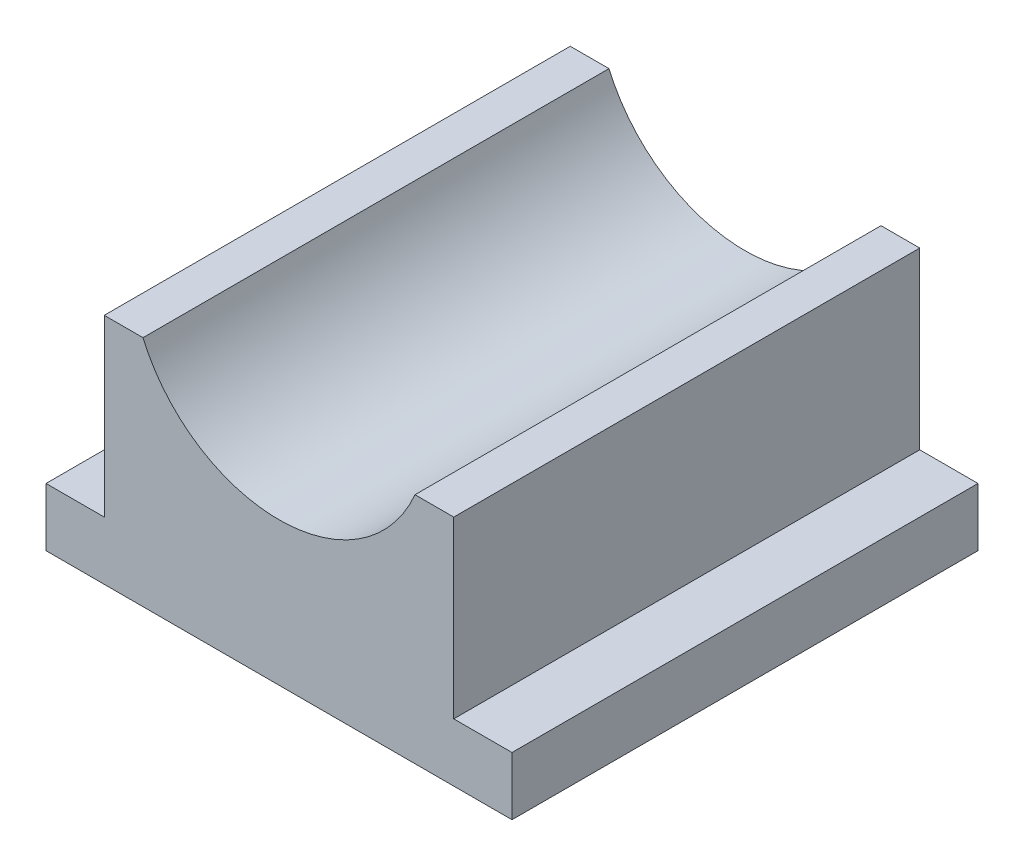
ISO-10303-21;
HEADER;
FILE_DESCRIPTION(('STEP AP214'),'2;1');
FILE_NAME('part.step','',(''),(''),'','','');
FILE_SCHEMA(('AUTOMOTIVE_DESIGN { 1 0 10303 214 1 1 1 1 }'));
ENDSEC;
DATA;
#1=APPLICATION_CONTEXT('core data for automotive mechanical design processes');
#2=APPLICATION_PROTOCOL_DEFINITION('international standard','automotive_design',2000,#1);
#3=PRODUCT_CONTEXT('',#1,'mechanical');
#4=PRODUCT('Part','Part','',(#3));
#5=PRODUCT_RELATED_PRODUCT_CATEGORY('part','',(#4));
#6=PRODUCT_DEFINITION_FORMATION('','',#4);
#7=PRODUCT_DEFINITION_CONTEXT('part definition',#1,'design');
#8=PRODUCT_DEFINITION('design','',#6,#7);
#9=PRODUCT_DEFINITION_SHAPE('','',#8);
#10=(LENGTH_UNIT() NAMED_UNIT(*) SI_UNIT(.MILLI.,.METRE.));
#11=(NAMED_UNIT(*) PLANE_ANGLE_UNIT() SI_UNIT($,.RADIAN.));
#12=(NAMED_UNIT(*) SI_UNIT($,.STERADIAN.) SOLID_ANGLE_UNIT());
#13=UNCERTAINTY_MEASURE_WITH_UNIT(LENGTH_MEASURE(1.E-05),#10,'distance_accuracy_value','');
#14=(GEOMETRIC_REPRESENTATION_CONTEXT(3) GLOBAL_UNCERTAINTY_ASSIGNED_CONTEXT((#13)) GLOBAL_UNIT_ASSIGNED_CONTEXT((#10,
#11,#12)) REPRESENTATION_CONTEXT('',''));
#15=CARTESIAN_POINT('',(0.,0.,0.));
#16=DIRECTION('',(0.,0.,1.));
#17=DIRECTION('',(1.,0.,0.));
#18=AXIS2_PLACEMENT_3D('',#15,#16,#17);
#19=CARTESIAN_POINT('',(-50.8,-50.8,101.6));
#20=DIRECTION('',(1.,0.,0.));
#21=DIRECTION('',(0.,1.,0.));
#22=AXIS2_PLACEMENT_3D('',#19,#20,#21);
#23=PLANE('',#22);
#24=DIRECTION('',(0.,-1.,0.));
#25=VECTOR('',#24,1.);
#26=CARTESIAN_POINT('',(-50.8,-50.8,0.));
#27=LINE('',#26,#25);
#28=CARTESIAN_POINT('',(-50.8,-50.8,0.));
#29=VERTEX_POINT('',#28);
#30=CARTESIAN_POINT('',(-50.8,-63.5,0.));
#31=VERTEX_POINT('',#30);
#32=EDGE_CURVE('E143',#29,#31,#27,.T.);
#33=ORIENTED_EDGE('',*,*,#32,.T.);
#34=DIRECTION('',(0.,0.,-1.));
#35=VECTOR('',#34,1.);
#36=CARTESIAN_POINT('',(-50.8,-63.5,101.6));
#37=LINE('',#36,#35);
#38=CARTESIAN_POINT('',(-50.8,-63.5,101.6));
#39=VERTEX_POINT('',#38);
#40=EDGE_CURVE('E11',#39,#31,#37,.T.);
#41=ORIENTED_EDGE('',*,*,#40,.F.);
#42=DIRECTION('',(0.,-1.,0.));
#43=VECTOR('',#42,1.);
#44=CARTESIAN_POINT('',(-50.8,-50.8,101.6));
#45=LINE('',#44,#43);
#46=CARTESIAN_POINT('',(-50.8,-50.8,101.6));
#47=VERTEX_POINT('',#46);
#48=EDGE_CURVE('E161',#47,#39,#45,.T.);
#49=ORIENTED_EDGE('',*,*,#48,.F.);
#50=DIRECTION('',(0.,0.,-1.));
#51=VECTOR('',#50,1.);
#52=CARTESIAN_POINT('',(-50.8,-50.8,101.6));
#53=LINE('',#52,#51);
#54=EDGE_CURVE('E139',#47,#29,#53,.T.);
#55=ORIENTED_EDGE('',*,*,#54,.T.);
#56=EDGE_LOOP('',(#33,#41,#49,#55));
#57=FACE_BOUND('',#56,.T.);
#58=ADVANCED_FACE('F35',(#57),#23,.F.);
#59=CARTESIAN_POINT('',(-50.8,-63.5,101.6));
#60=DIRECTION('',(0.,1.,0.));
#61=DIRECTION('',(-1.,0.,0.));
#62=AXIS2_PLACEMENT_3D('',#59,#60,#61);
#63=PLANE('',#62);
#64=DIRECTION('',(1.,0.,0.));
#65=VECTOR('',#64,1.);
#66=CARTESIAN_POINT('',(-50.8,-63.5,0.));
#67=LINE('',#66,#65);
#68=CARTESIAN_POINT('',(50.8,-63.5,0.));
#69=VERTEX_POINT('',#68);
#70=EDGE_CURVE('E146',#31,#69,#67,.T.);
#71=ORIENTED_EDGE('',*,*,#70,.T.);
#72=DIRECTION('',(0.,0.,-1.));
#73=VECTOR('',#72,1.);
#74=CARTESIAN_POINT('',(50.8,-63.5,101.6));
#75=LINE('',#74,#73);
#76=CARTESIAN_POINT('',(50.8,-63.5,101.6));
#77=VERTEX_POINT('',#76);
#78=EDGE_CURVE('E43',#77,#69,#75,.T.);
#79=ORIENTED_EDGE('',*,*,#78,.F.);
#80=DIRECTION('',(1.,0.,0.));
#81=VECTOR('',#80,1.);
#82=CARTESIAN_POINT('',(-50.8,-63.5,101.6));
#83=LINE('',#82,#81);
#84=EDGE_CURVE('E100',#39,#77,#83,.T.);
#85=ORIENTED_EDGE('',*,*,#84,.F.);
#86=ORIENTED_EDGE('',*,*,#40,.T.);
#87=EDGE_LOOP('',(#71,#79,#85,#86));
#88=FACE_BOUND('',#87,.T.);
#89=ADVANCED_FACE('F210',(#88),#63,.F.);
#90=CARTESIAN_POINT('',(50.8,-63.5,101.6));
#91=DIRECTION('',(-1.,0.,0.));
#92=DIRECTION('',(0.,-1.,0.));
#93=AXIS2_PLACEMENT_3D('',#90,#91,#92);
#94=PLANE('',#93);
#95=DIRECTION('',(0.,1.,0.));
#96=VECTOR('',#95,1.);
#97=CARTESIAN_POINT('',(50.8,-63.5,0.));
#98=LINE('',#97,#96);
#99=CARTESIAN_POINT('',(50.8,-50.8,0.));
#100=VERTEX_POINT('',#99);
#101=EDGE_CURVE('E148',#69,#100,#98,.T.);
#102=ORIENTED_EDGE('',*,*,#101,.T.);
#103=DIRECTION('',(0.,0.,-1.));
#104=VECTOR('',#103,1.);
#105=CARTESIAN_POINT('',(50.8,-50.8,101.6));
#106=LINE('',#105,#104);
#107=CARTESIAN_POINT('',(50.8,-50.8,101.6));
#108=VERTEX_POINT('',#107);
#109=EDGE_CURVE('E174',#108,#100,#106,.T.);
#110=ORIENTED_EDGE('',*,*,#109,.F.);
#111=DIRECTION('',(0.,1.,0.));
#112=VECTOR('',#111,1.);
#113=CARTESIAN_POINT('',(50.8,-63.5,101.6));
#114=LINE('',#113,#112);
#115=EDGE_CURVE('E182',#77,#108,#114,.T.);
#116=ORIENTED_EDGE('',*,*,#115,.F.);
#117=ORIENTED_EDGE('',*,*,#78,.T.);
#118=EDGE_LOOP('',(#102,#110,#116,#117));
#119=FACE_BOUND('',#118,.T.);
#120=ADVANCED_FACE('F180',(#119),#94,.F.);
#121=CARTESIAN_POINT('',(50.8,-50.8,101.6));
#122=DIRECTION('',(0.,-1.,0.));
#123=DIRECTION('',(1.,0.,0.));
#124=AXIS2_PLACEMENT_3D('',#121,#122,#123);
#125=PLANE('',#124);
#126=DIRECTION('',(-1.,0.,0.));
#127=VECTOR('',#126,1.);
#128=CARTESIAN_POINT('',(50.8,-50.8,0.));
#129=LINE('',#128,#127);
#130=CARTESIAN_POINT('',(38.1,-50.8,0.));
#131=VERTEX_POINT('',#130);
#132=EDGE_CURVE('E150',#100,#131,#129,.T.);
#133=ORIENTED_EDGE('',*,*,#132,.T.);
#134=DIRECTION('',(0.,0.,-1.));
#135=VECTOR('',#134,1.);
#136=CARTESIAN_POINT('',(38.1,-50.8,101.6));
#137=LINE('',#136,#135);
#138=CARTESIAN_POINT('',(38.1,-50.8,101.6));
#139=VERTEX_POINT('',#138);
#140=EDGE_CURVE('E171',#139,#131,#137,.T.);
#141=ORIENTED_EDGE('',*,*,#140,.F.);
#142=DIRECTION('',(-1.,0.,0.));
#143=VECTOR('',#142,1.);
#144=CARTESIAN_POINT('',(50.8,-50.8,101.6));
#145=LINE('',#144,#143);
#146=EDGE_CURVE('E200',#108,#139,#145,.T.);
#147=ORIENTED_EDGE('',*,*,#146,.F.);
#148=ORIENTED_EDGE('',*,*,#109,.T.);
#149=EDGE_LOOP('',(#133,#141,#147,#148));
#150=FACE_BOUND('',#149,.T.);
#151=ADVANCED_FACE('F191',(#150),#125,.F.);
#152=CARTESIAN_POINT('',(38.1,-12.7,101.6));
#153=DIRECTION('',(-1.,0.,0.));
#154=DIRECTION('',(0.,-1.,0.));
#155=AXIS2_PLACEMENT_3D('',#152,#153,#154);
#156=PLANE('',#155);
#157=DIRECTION('',(0.,1.,0.));
#158=VECTOR('',#157,1.);
#159=CARTESIAN_POINT('',(38.1,-12.7,0.));
#160=LINE('',#159,#158);
#161=CARTESIAN_POINT('',(38.1,-12.7,0.));
#162=VERTEX_POINT('',#161);
#163=EDGE_CURVE('E152',#131,#162,#160,.T.);
#164=ORIENTED_EDGE('',*,*,#163,.T.);
#165=DIRECTION('',(0.,0.,-1.));
#166=VECTOR('',#165,1.);
#167=CARTESIAN_POINT('',(38.1,-12.7,101.6));
#168=LINE('',#167,#166);
#169=CARTESIAN_POINT('',(38.1,-12.7,101.6));
#170=VERTEX_POINT('',#169);
#171=EDGE_CURVE('E168',#170,#162,#168,.T.);
#172=ORIENTED_EDGE('',*,*,#171,.F.);
#173=DIRECTION('',(0.,1.,0.));
#174=VECTOR('',#173,1.);
#175=CARTESIAN_POINT('',(38.1,-12.7,101.6));
#176=LINE('',#175,#174);
#177=EDGE_CURVE('E197',#139,#170,#176,.T.);
#178=ORIENTED_EDGE('',*,*,#177,.F.);
#179=ORIENTED_EDGE('',*,*,#140,.T.);
#180=EDGE_LOOP('',(#164,#172,#178,#179));
#181=FACE_BOUND('',#180,.T.);
#182=ADVANCED_FACE('F195',(#181),#156,.F.);
#183=CARTESIAN_POINT('',(29.6528002724869,-12.7,101.6));
#184=DIRECTION('',(0.,-1.,0.));
#185=DIRECTION('',(0.,0.,-1.));
#186=AXIS2_PLACEMENT_3D('',#183,#184,#185);
#187=PLANE('',#186);
#188=DIRECTION('',(-1.,0.,0.));
#189=VECTOR('',#188,1.);
#190=CARTESIAN_POINT('',(29.6528002724869,-12.7,0.));
#191=LINE('',#190,#189);
#192=CARTESIAN_POINT('',(29.6528002724869,-12.7,0.));
#193=VERTEX_POINT('',#192);
#194=EDGE_CURVE('E154',#162,#193,#191,.T.);
#195=ORIENTED_EDGE('',*,*,#194,.T.);
#196=DIRECTION('',(0.,0.,-1.));
#197=VECTOR('',#196,1.);
#198=CARTESIAN_POINT('',(29.6528002724869,-12.7,101.6));
#199=LINE('',#198,#197);
#200=CARTESIAN_POINT('',(29.6528002724869,-12.7,101.6));
#201=VERTEX_POINT('',#200);
#202=EDGE_CURVE('E165',#201,#193,#199,.T.);
#203=ORIENTED_EDGE('',*,*,#202,.F.);
#204=DIRECTION('',(-1.,0.,0.));
#205=VECTOR('',#204,1.);
#206=CARTESIAN_POINT('',(29.6528002724869,-12.7,101.6));
#207=LINE('',#206,#205);
#208=EDGE_CURVE('E199',#170,#201,#207,.T.);
#209=ORIENTED_EDGE('',*,*,#208,.F.);
#210=ORIENTED_EDGE('',*,*,#171,.T.);
#211=EDGE_LOOP('',(#195,#203,#209,#210));
#212=FACE_BOUND('',#211,.T.);
#213=ADVANCED_FACE('F222',(#212),#187,.F.);
#214=CARTESIAN_POINT('',(0.,0.,101.6));
#215=DIRECTION('',(0.,0.,-1.));
#216=DIRECTION('',(-1.,0.,0.));
#217=AXIS2_PLACEMENT_3D('',#214,#215,#216);
#218=CYLINDRICAL_SURFACE('',#217,32.258);
#219=CARTESIAN_POINT('',(0.,0.,0.));
#220=DIRECTION('',(0.,0.,-1.));
#221=DIRECTION('',(-1.,0.,0.));
#222=AXIS2_PLACEMENT_3D('',#219,#220,#221);
#223=CIRCLE('',#222,32.258);
#224=CARTESIAN_POINT('',(-29.6528002724869,-12.7,0.));
#225=VERTEX_POINT('',#224);
#226=EDGE_CURVE('E156',#193,#225,#223,.T.);
#227=ORIENTED_EDGE('',*,*,#226,.T.);
#228=DIRECTION('',(0.,0.,-1.));
#229=VECTOR('',#228,1.);
#230=CARTESIAN_POINT('',(-29.6528002724869,-12.7,101.6));
#231=LINE('',#230,#229);
#232=CARTESIAN_POINT('',(-29.6528002724869,-12.7,101.6));
#233=VERTEX_POINT('',#232);
#234=EDGE_CURVE('E134',#233,#225,#231,.T.);
#235=ORIENTED_EDGE('',*,*,#234,.F.);
#236=CARTESIAN_POINT('',(0.,0.,101.6));
#237=DIRECTION('',(0.,0.,-1.));
#238=DIRECTION('',(-1.,0.,0.));
#239=AXIS2_PLACEMENT_3D('',#236,#237,#238);
#240=CIRCLE('',#239,32.258);
#241=EDGE_CURVE('E125',#201,#233,#240,.T.);
#242=ORIENTED_EDGE('',*,*,#241,.F.);
#243=ORIENTED_EDGE('',*,*,#202,.T.);
#244=EDGE_LOOP('',(#227,#235,#242,#243));
#245=FACE_BOUND('',#244,.T.);
#246=ADVANCED_FACE('F225',(#245),#218,.F.);
#247=CARTESIAN_POINT('',(-29.6528002724869,-12.7,101.6));
#248=DIRECTION('',(0.,-1.,0.));
#249=DIRECTION('',(0.,0.,-1.));
#250=AXIS2_PLACEMENT_3D('',#247,#248,#249);
#251=PLANE('',#250);
#252=DIRECTION('',(-1.,0.,0.));
#253=VECTOR('',#252,1.);
#254=CARTESIAN_POINT('',(-29.6528002724869,-12.7,0.));
#255=LINE('',#254,#253);
#256=CARTESIAN_POINT('',(-38.1,-12.7,0.));
#257=VERTEX_POINT('',#256);
#258=EDGE_CURVE('E133',#225,#257,#255,.T.);
#259=ORIENTED_EDGE('',*,*,#258,.T.);
#260=DIRECTION('',(0.,0.,-1.));
#261=VECTOR('',#260,1.);
#262=CARTESIAN_POINT('',(-38.1,-12.7,101.6));
#263=LINE('',#262,#261);
#264=CARTESIAN_POINT('',(-38.1,-12.7,101.6));
#265=VERTEX_POINT('',#264);
#266=EDGE_CURVE('E130',#265,#257,#263,.T.);
#267=ORIENTED_EDGE('',*,*,#266,.F.);
#268=DIRECTION('',(-1.,0.,0.));
#269=VECTOR('',#268,1.);
#270=CARTESIAN_POINT('',(-29.6528002724869,-12.7,101.6));
#271=LINE('',#270,#269);
#272=EDGE_CURVE('E119',#233,#265,#271,.T.);
#273=ORIENTED_EDGE('',*,*,#272,.F.);
#274=ORIENTED_EDGE('',*,*,#234,.T.);
#275=EDGE_LOOP('',(#259,#267,#273,#274));
#276=FACE_BOUND('',#275,.T.);
#277=ADVANCED_FACE('F131',(#276),#251,.F.);
#278=CARTESIAN_POINT('',(-38.1,-12.7,101.6));
#279=DIRECTION('',(1.,0.,0.));
#280=DIRECTION('',(0.,1.,0.));
#281=AXIS2_PLACEMENT_3D('',#278,#279,#280);
#282=PLANE('',#281);
#283=DIRECTION('',(0.,-1.,0.));
#284=VECTOR('',#283,1.);
#285=CARTESIAN_POINT('',(-38.1,-12.7,0.));
#286=LINE('',#285,#284);
#287=CARTESIAN_POINT('',(-38.1,-50.8,0.));
#288=VERTEX_POINT('',#287);
#289=EDGE_CURVE('E86',#257,#288,#286,.T.);
#290=ORIENTED_EDGE('',*,*,#289,.T.);
#291=DIRECTION('',(0.,0.,-1.));
#292=VECTOR('',#291,1.);
#293=CARTESIAN_POINT('',(-38.1,-50.8,101.6));
#294=LINE('',#293,#292);
#295=CARTESIAN_POINT('',(-38.1,-50.8,101.6));
#296=VERTEX_POINT('',#295);
#297=EDGE_CURVE('E135',#296,#288,#294,.T.);
#298=ORIENTED_EDGE('',*,*,#297,.F.);
#299=DIRECTION('',(0.,-1.,0.));
#300=VECTOR('',#299,1.);
#301=CARTESIAN_POINT('',(-38.1,-12.7,101.6));
#302=LINE('',#301,#300);
#303=EDGE_CURVE('E123',#265,#296,#302,.T.);
#304=ORIENTED_EDGE('',*,*,#303,.F.);
#305=ORIENTED_EDGE('',*,*,#266,.T.);
#306=EDGE_LOOP('',(#290,#298,#304,#305));
#307=FACE_BOUND('',#306,.T.);
#308=ADVANCED_FACE('F137',(#307),#282,.F.);
#309=CARTESIAN_POINT('',(-38.1,-50.8,101.6));
#310=DIRECTION('',(0.,-1.,0.));
#311=DIRECTION('',(0.,0.,-1.));
#312=AXIS2_PLACEMENT_3D('',#309,#310,#311);
#313=PLANE('',#312);
#314=DIRECTION('',(-1.,0.,0.));
#315=VECTOR('',#314,1.);
#316=CARTESIAN_POINT('',(-38.1,-50.8,0.));
#317=LINE('',#316,#315);
#318=EDGE_CURVE('E92',#288,#29,#317,.T.);
#319=ORIENTED_EDGE('',*,*,#318,.T.);
#320=ORIENTED_EDGE('',*,*,#54,.F.);
#321=DIRECTION('',(-1.,0.,0.));
#322=VECTOR('',#321,1.);
#323=CARTESIAN_POINT('',(-38.1,-50.8,101.6));
#324=LINE('',#323,#322);
#325=EDGE_CURVE('E51',#296,#47,#324,.T.);
#326=ORIENTED_EDGE('',*,*,#325,.F.);
#327=ORIENTED_EDGE('',*,*,#297,.T.);
#328=EDGE_LOOP('',(#319,#320,#326,#327));
#329=FACE_BOUND('',#328,.T.);
#330=ADVANCED_FACE('F234',(#329),#313,.F.);
#331=CARTESIAN_POINT('',(0.,0.,101.6));
#332=DIRECTION('',(0.,0.,-1.));
#333=DIRECTION('',(-1.,0.,0.));
#334=AXIS2_PLACEMENT_3D('',#331,#332,#333);
#335=PLANE('',#334);
#336=ORIENTED_EDGE('',*,*,#48,.T.);
#337=ORIENTED_EDGE('',*,*,#84,.T.);
#338=ORIENTED_EDGE('',*,*,#115,.T.);
#339=ORIENTED_EDGE('',*,*,#146,.T.);
#340=ORIENTED_EDGE('',*,*,#177,.T.);
#341=ORIENTED_EDGE('',*,*,#208,.T.);
#342=ORIENTED_EDGE('',*,*,#241,.T.);
#343=ORIENTED_EDGE('',*,*,#272,.T.);
#344=ORIENTED_EDGE('',*,*,#303,.T.);
#345=ORIENTED_EDGE('',*,*,#325,.T.);
#346=EDGE_LOOP('',(#336,#337,#338,#339,#340,#341,#342,#343,#344,#345));
#347=FACE_BOUND('',#346,.T.);
#348=ADVANCED_FACE('F121',(#347),#335,.F.);
#349=CARTESIAN_POINT('',(0.,0.,0.));
#350=DIRECTION('',(0.,0.,-1.));
#351=DIRECTION('',(-1.,0.,0.));
#352=AXIS2_PLACEMENT_3D('',#349,#350,#351);
#353=PLANE('',#352);
#354=ORIENTED_EDGE('',*,*,#32,.F.);
#355=ORIENTED_EDGE('',*,*,#318,.F.);
#356=ORIENTED_EDGE('',*,*,#289,.F.);
#357=ORIENTED_EDGE('',*,*,#258,.F.);
#358=ORIENTED_EDGE('',*,*,#226,.F.);
#359=ORIENTED_EDGE('',*,*,#194,.F.);
#360=ORIENTED_EDGE('',*,*,#163,.F.);
#361=ORIENTED_EDGE('',*,*,#132,.F.);
#362=ORIENTED_EDGE('',*,*,#101,.F.);
#363=ORIENTED_EDGE('',*,*,#70,.F.);
#364=EDGE_LOOP('',(#354,#355,#356,#357,#358,#359,#360,#361,#362,#363));
#365=FACE_BOUND('',#364,.T.);
#366=ADVANCED_FACE('F186',(#365),#353,.T.);
#367=CLOSED_SHELL('',(#58,#89,#120,#151,#182,#213,#246,#277,#308,#330,#348,#366));
#368=MANIFOLD_SOLID_BREP('B2',#367);
#369=ADVANCED_BREP_SHAPE_REPRESENTATION('',(#18,#368),#14);
#370=SHAPE_DEFINITION_REPRESENTATION(#9,#369);
ENDSEC;
END-ISO-10303-21;
